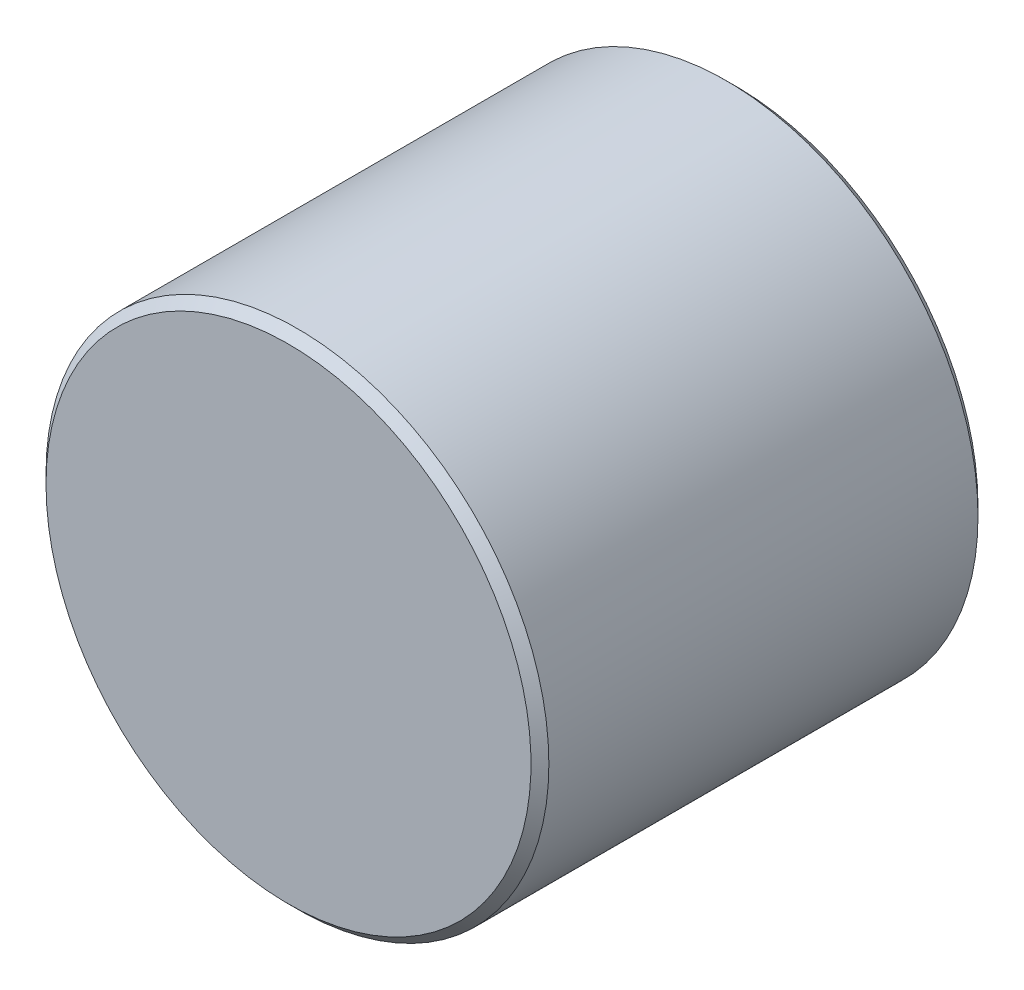
ISO-10303-21;
HEADER;
FILE_DESCRIPTION(('STEP AP214'),'2;1');
FILE_NAME('part.step','',(''),(''),'','','');
FILE_SCHEMA(('AUTOMOTIVE_DESIGN { 1 0 10303 214 1 1 1 1 }'));
ENDSEC;
DATA;
#1=APPLICATION_CONTEXT('core data for automotive mechanical design processes');
#2=APPLICATION_PROTOCOL_DEFINITION('international standard','automotive_design',2000,#1);
#3=PRODUCT_CONTEXT('',#1,'mechanical');
#4=PRODUCT('Part','Part','',(#3));
#5=PRODUCT_RELATED_PRODUCT_CATEGORY('part','',(#4));
#6=PRODUCT_DEFINITION_FORMATION('','',#4);
#7=PRODUCT_DEFINITION_CONTEXT('part definition',#1,'design');
#8=PRODUCT_DEFINITION('design','',#6,#7);
#9=PRODUCT_DEFINITION_SHAPE('','',#8);
#10=(LENGTH_UNIT() NAMED_UNIT(*) SI_UNIT(.MILLI.,.METRE.));
#11=(NAMED_UNIT(*) PLANE_ANGLE_UNIT() SI_UNIT($,.RADIAN.));
#12=(NAMED_UNIT(*) SI_UNIT($,.STERADIAN.) SOLID_ANGLE_UNIT());
#13=UNCERTAINTY_MEASURE_WITH_UNIT(LENGTH_MEASURE(1.E-05),#10,'distance_accuracy_value','');
#14=(GEOMETRIC_REPRESENTATION_CONTEXT(3) GLOBAL_UNCERTAINTY_ASSIGNED_CONTEXT((#13)) GLOBAL_UNIT_ASSIGNED_CONTEXT((#10,
#11,#12)) REPRESENTATION_CONTEXT('',''));
#15=CARTESIAN_POINT('',(0.,0.,0.));
#16=DIRECTION('',(0.,0.,1.));
#17=DIRECTION('',(1.,0.,0.));
#18=AXIS2_PLACEMENT_3D('',#15,#16,#17);
#19=CARTESIAN_POINT('',(0.,0.,12.7));
#20=DIRECTION('',(0.,0.,1.));
#21=DIRECTION('',(1.,0.,0.));
#22=AXIS2_PLACEMENT_3D('',#19,#20,#21);
#23=PLANE('',#22);
#24=CARTESIAN_POINT('',(0.,0.,12.6999999999994));
#25=DIRECTION('',(0.,0.,-1.));
#26=DIRECTION('',(-1.,0.,0.));
#27=AXIS2_PLACEMENT_3D('',#24,#25,#26);
#28=CIRCLE('',#27,6.88974999999936);
#29=CARTESIAN_POINT('',(-6.88974999999936,0.,12.6999999999994));
#30=VERTEX_POINT('',#29);
#31=EDGE_CURVE('E19',#30,#30,#28,.T.);
#32=ORIENTED_EDGE('',*,*,#31,.F.);
#33=EDGE_LOOP('',(#32));
#34=FACE_BOUND('',#33,.T.);
#35=ADVANCED_FACE('F16',(#34),#23,.T.);
#36=CARTESIAN_POINT('',(0.,0.,0.));
#37=DIRECTION('',(0.,0.,1.));
#38=DIRECTION('',(1.,0.,0.));
#39=AXIS2_PLACEMENT_3D('',#36,#37,#38);
#40=PLANE('',#39);
#41=CARTESIAN_POINT('',(0.,0.,6.50846564143048E-13));
#42=DIRECTION('',(0.,0.,1.));
#43=DIRECTION('',(1.,0.,0.));
#44=AXIS2_PLACEMENT_3D('',#41,#42,#43);
#45=CIRCLE('',#44,6.88974999999935);
#46=CARTESIAN_POINT('',(6.88974999999935,0.,6.50846564143048E-13));
#47=VERTEX_POINT('',#46);
#48=EDGE_CURVE('E28',#47,#47,#45,.T.);
#49=ORIENTED_EDGE('',*,*,#48,.F.);
#50=EDGE_LOOP('',(#49));
#51=FACE_BOUND('',#50,.T.);
#52=ADVANCED_FACE('F43',(#51),#40,.F.);
#53=CARTESIAN_POINT('',(0.,0.,12.446));
#54=DIRECTION('',(0.,0.,-1.));
#55=DIRECTION('',(-1.,0.,0.));
#56=AXIS2_PLACEMENT_3D('',#53,#54,#55);
#57=CONICAL_SURFACE('',#56,7.14375000000001,0.785398163400003);
#58=CARTESIAN_POINT('',(0.,0.,12.446));
#59=DIRECTION('',(0.,0.,1.));
#60=DIRECTION('',(1.,0.,0.));
#61=AXIS2_PLACEMENT_3D('',#58,#59,#60);
#62=CIRCLE('',#61,7.14375);
#63=CARTESIAN_POINT('',(7.14375,0.,12.446));
#64=VERTEX_POINT('',#63);
#65=EDGE_CURVE('E23',#64,#64,#62,.F.);
#66=ORIENTED_EDGE('',*,*,#65,.F.);
#67=EDGE_LOOP('',(#66));
#68=FACE_BOUND('',#67,.T.);
#69=ORIENTED_EDGE('',*,*,#31,.T.);
#70=EDGE_LOOP('',(#69));
#71=FACE_BOUND('',#70,.T.);
#72=ADVANCED_FACE('F40',(#68,#71),#57,.T.);
#73=CARTESIAN_POINT('',(0.,0.,0.254000000000003));
#74=DIRECTION('',(0.,0.,1.));
#75=DIRECTION('',(1.,0.,0.));
#76=AXIS2_PLACEMENT_3D('',#73,#74,#75);
#77=CONICAL_SURFACE('',#76,7.14375,0.785398163400003);
#78=CARTESIAN_POINT('',(0.,0.,0.254000000000001));
#79=DIRECTION('',(0.,0.,1.));
#80=DIRECTION('',(1.,0.,0.));
#81=AXIS2_PLACEMENT_3D('',#78,#79,#80);
#82=CIRCLE('',#81,7.14375);
#83=CARTESIAN_POINT('',(7.14375,0.,0.254000000000001));
#84=VERTEX_POINT('',#83);
#85=EDGE_CURVE('E10',#84,#84,#82,.T.);
#86=ORIENTED_EDGE('',*,*,#85,.F.);
#87=EDGE_LOOP('',(#86));
#88=FACE_BOUND('',#87,.T.);
#89=ORIENTED_EDGE('',*,*,#48,.T.);
#90=EDGE_LOOP('',(#89));
#91=FACE_BOUND('',#90,.T.);
#92=ADVANCED_FACE('F50',(#88,#91),#77,.T.);
#93=CARTESIAN_POINT('',(0.,0.,0.));
#94=DIRECTION('',(0.,0.,1.));
#95=DIRECTION('',(1.,0.,0.));
#96=AXIS2_PLACEMENT_3D('',#93,#94,#95);
#97=CYLINDRICAL_SURFACE('',#96,7.14375);
#98=ORIENTED_EDGE('',*,*,#85,.T.);
#99=EDGE_LOOP('',(#98));
#100=FACE_BOUND('',#99,.T.);
#101=ORIENTED_EDGE('',*,*,#65,.T.);
#102=EDGE_LOOP('',(#101));
#103=FACE_BOUND('',#102,.T.);
#104=ADVANCED_FACE('F48',(#100,#103),#97,.T.);
#105=CLOSED_SHELL('',(#35,#52,#72,#92,#104));
#106=MANIFOLD_SOLID_BREP('B1',#105);
#107=ADVANCED_BREP_SHAPE_REPRESENTATION('',(#18,#106),#14);
#108=SHAPE_DEFINITION_REPRESENTATION(#9,#107);
ENDSEC;
END-ISO-10303-21;
